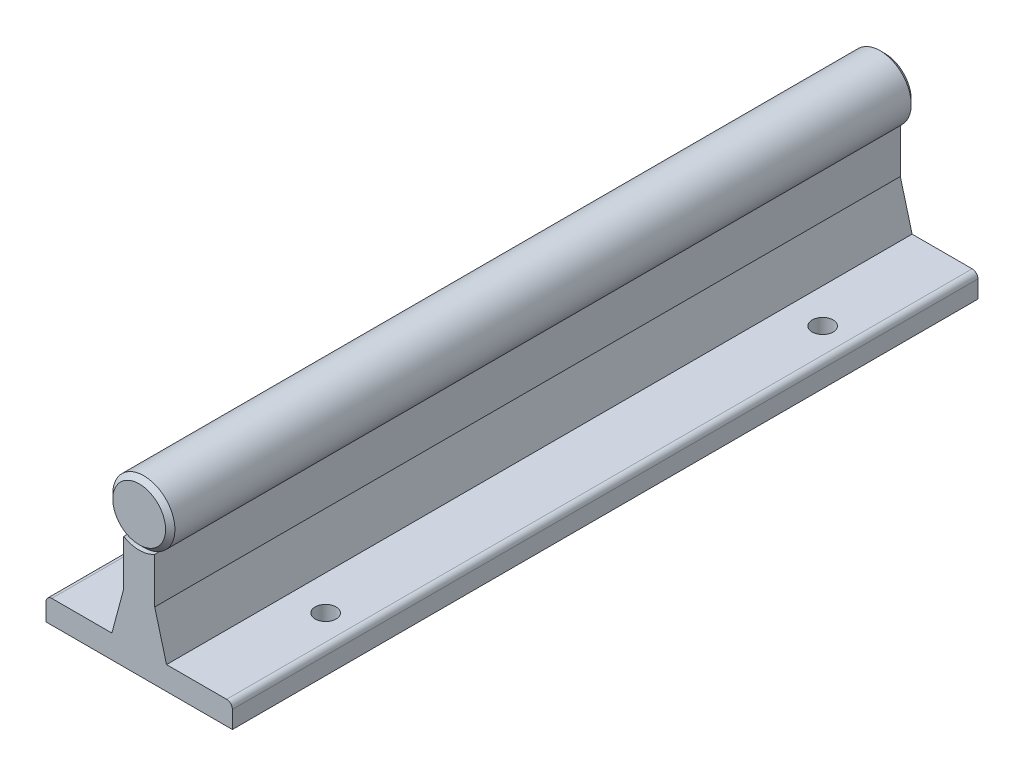
ISO-10303-21;
HEADER;
FILE_DESCRIPTION(('STEP AP214'),'2;1');
FILE_NAME('part.step','',(''),(''),'','','');
FILE_SCHEMA(('AUTOMOTIVE_DESIGN { 1 0 10303 214 1 1 1 1 }'));
ENDSEC;
DATA;
#1=APPLICATION_CONTEXT('core data for automotive mechanical design processes');
#2=APPLICATION_PROTOCOL_DEFINITION('international standard','automotive_design',2000,#1);
#3=PRODUCT_CONTEXT('',#1,'mechanical');
#4=PRODUCT('Part','Part','',(#3));
#5=PRODUCT_RELATED_PRODUCT_CATEGORY('part','',(#4));
#6=PRODUCT_DEFINITION_FORMATION('','',#4);
#7=PRODUCT_DEFINITION_CONTEXT('part definition',#1,'design');
#8=PRODUCT_DEFINITION('design','',#6,#7);
#9=PRODUCT_DEFINITION_SHAPE('','',#8);
#10=(LENGTH_UNIT() NAMED_UNIT(*) SI_UNIT(.MILLI.,.METRE.));
#11=(NAMED_UNIT(*) PLANE_ANGLE_UNIT() SI_UNIT($,.RADIAN.));
#12=(NAMED_UNIT(*) SI_UNIT($,.STERADIAN.) SOLID_ANGLE_UNIT());
#13=UNCERTAINTY_MEASURE_WITH_UNIT(LENGTH_MEASURE(1.E-05),#10,'distance_accuracy_value','');
#14=(GEOMETRIC_REPRESENTATION_CONTEXT(3) GLOBAL_UNCERTAINTY_ASSIGNED_CONTEXT((#13)) GLOBAL_UNIT_ASSIGNED_CONTEXT((#10,
#11,#12)) REPRESENTATION_CONTEXT('',''));
#15=CARTESIAN_POINT('',(0.,0.,0.));
#16=DIRECTION('',(0.,0.,1.));
#17=DIRECTION('',(1.,0.,0.));
#18=AXIS2_PLACEMENT_3D('',#15,#16,#17);
#19=CARTESIAN_POINT('',(-19.05,0.,76.2));
#20=DIRECTION('',(0.,1.,0.));
#21=DIRECTION('',(0.,0.,1.));
#22=AXIS2_PLACEMENT_3D('',#19,#20,#21);
#23=PLANE('',#22);
#24=CARTESIAN_POINT('',(12.7,0.,-50.8));
#25=DIRECTION('',(0.,1.,0.));
#26=DIRECTION('',(0.,0.,1.));
#27=AXIS2_PLACEMENT_3D('',#24,#25,#26);
#28=CIRCLE('',#27,2.1463);
#29=CARTESIAN_POINT('',(12.7,0.,-48.6537));
#30=VERTEX_POINT('',#29);
#31=EDGE_CURVE('E386',#30,#30,#28,.T.);
#32=ORIENTED_EDGE('',*,*,#31,.T.);
#33=EDGE_LOOP('',(#32));
#34=FACE_BOUND('',#33,.T.);
#35=CARTESIAN_POINT('',(12.7,0.,50.8));
#36=DIRECTION('',(0.,1.,0.));
#37=DIRECTION('',(0.,0.,1.));
#38=AXIS2_PLACEMENT_3D('',#35,#36,#37);
#39=CIRCLE('',#38,2.1463);
#40=CARTESIAN_POINT('',(12.7,0.,52.9463));
#41=VERTEX_POINT('',#40);
#42=EDGE_CURVE('E401',#41,#41,#39,.T.);
#43=ORIENTED_EDGE('',*,*,#42,.T.);
#44=EDGE_LOOP('',(#43));
#45=FACE_BOUND('',#44,.T.);
#46=DIRECTION('',(1.,0.,0.));
#47=VECTOR('',#46,1.);
#48=CARTESIAN_POINT('',(-19.05,0.,-76.2));
#49=LINE('',#48,#47);
#50=CARTESIAN_POINT('',(-19.05,0.,-76.2));
#51=VERTEX_POINT('',#50);
#52=CARTESIAN_POINT('',(19.05,0.,-76.2));
#53=VERTEX_POINT('',#52);
#54=EDGE_CURVE('E252',#51,#53,#49,.T.);
#55=ORIENTED_EDGE('',*,*,#54,.T.);
#56=DIRECTION('',(0.,0.,-1.));
#57=VECTOR('',#56,1.);
#58=CARTESIAN_POINT('',(19.05,0.,76.2));
#59=LINE('',#58,#57);
#60=CARTESIAN_POINT('',(19.05,0.,76.2));
#61=VERTEX_POINT('',#60);
#62=EDGE_CURVE('E217',#61,#53,#59,.T.);
#63=ORIENTED_EDGE('',*,*,#62,.F.);
#64=DIRECTION('',(1.,0.,0.));
#65=VECTOR('',#64,1.);
#66=CARTESIAN_POINT('',(-19.05,0.,76.2));
#67=LINE('',#66,#65);
#68=CARTESIAN_POINT('',(-19.05,0.,76.2));
#69=VERTEX_POINT('',#68);
#70=EDGE_CURVE('E421',#69,#61,#67,.T.);
#71=ORIENTED_EDGE('',*,*,#70,.F.);
#72=DIRECTION('',(0.,0.,-1.));
#73=VECTOR('',#72,1.);
#74=CARTESIAN_POINT('',(-19.05,0.,76.2));
#75=LINE('',#74,#73);
#76=EDGE_CURVE('E221',#69,#51,#75,.T.);
#77=ORIENTED_EDGE('',*,*,#76,.T.);
#78=EDGE_LOOP('',(#55,#63,#71,#77));
#79=FACE_BOUND('',#78,.T.);
#80=CARTESIAN_POINT('',(-12.7,0.,50.8));
#81=DIRECTION('',(0.,1.,0.));
#82=DIRECTION('',(0.,0.,1.));
#83=AXIS2_PLACEMENT_3D('',#80,#81,#82);
#84=CIRCLE('',#83,2.1463);
#85=CARTESIAN_POINT('',(-12.7,0.,52.9463));
#86=VERTEX_POINT('',#85);
#87=EDGE_CURVE('E393',#86,#86,#84,.T.);
#88=ORIENTED_EDGE('',*,*,#87,.T.);
#89=EDGE_LOOP('',(#88));
#90=FACE_BOUND('',#89,.T.);
#91=CARTESIAN_POINT('',(-12.7,0.,-50.8));
#92=DIRECTION('',(0.,1.,0.));
#93=DIRECTION('',(0.,0.,1.));
#94=AXIS2_PLACEMENT_3D('',#91,#92,#93);
#95=CIRCLE('',#94,2.1463);
#96=CARTESIAN_POINT('',(-12.7,0.,-48.6537));
#97=VERTEX_POINT('',#96);
#98=EDGE_CURVE('E383',#97,#97,#95,.T.);
#99=ORIENTED_EDGE('',*,*,#98,.T.);
#100=EDGE_LOOP('',(#99));
#101=FACE_BOUND('',#100,.T.);
#102=ADVANCED_FACE('F38',(#34,#45,#79,#90,#101),#23,.F.);
#103=CARTESIAN_POINT('',(-5.58598361192192,4.7625,76.2));
#104=DIRECTION('',(0.,-1.,0.));
#105=DIRECTION('',(1.,0.,0.));
#106=AXIS2_PLACEMENT_3D('',#103,#104,#105);
#107=PLANE('',#106);
#108=CARTESIAN_POINT('',(-12.7,4.7625,50.8));
#109=DIRECTION('',(0.,-1.,0.));
#110=DIRECTION('',(1.,0.,0.));
#111=AXIS2_PLACEMENT_3D('',#108,#109,#110);
#112=CIRCLE('',#111,2.1463);
#113=CARTESIAN_POINT('',(-10.5537,4.7625,50.8));
#114=VERTEX_POINT('',#113);
#115=EDGE_CURVE('E397',#114,#114,#112,.T.);
#116=ORIENTED_EDGE('',*,*,#115,.T.);
#117=EDGE_LOOP('',(#116));
#118=FACE_BOUND('',#117,.T.);
#119=DIRECTION('',(-1.,0.,0.));
#120=VECTOR('',#119,1.);
#121=CARTESIAN_POINT('',(-5.58598361192192,4.7625,-76.2));
#122=LINE('',#121,#120);
#123=CARTESIAN_POINT('',(-5.58598361192192,4.7625,-76.2));
#124=VERTEX_POINT('',#123);
#125=CARTESIAN_POINT('',(-17.859375,4.7625,-76.2));
#126=VERTEX_POINT('',#125);
#127=EDGE_CURVE('E186',#124,#126,#122,.T.);
#128=ORIENTED_EDGE('',*,*,#127,.T.);
#129=DIRECTION('',(0.,0.,-1.));
#130=VECTOR('',#129,1.);
#131=CARTESIAN_POINT('',(-17.859375,4.7625,76.2));
#132=LINE('',#131,#130);
#133=CARTESIAN_POINT('',(-17.859375,4.7625,76.2));
#134=VERTEX_POINT('',#133);
#135=EDGE_CURVE('E11',#126,#134,#132,.F.);
#136=ORIENTED_EDGE('',*,*,#135,.T.);
#137=DIRECTION('',(-1.,0.,0.));
#138=VECTOR('',#137,1.);
#139=CARTESIAN_POINT('',(-5.58598361192192,4.7625,76.2));
#140=LINE('',#139,#138);
#141=CARTESIAN_POINT('',(-5.58598361192192,4.7625,76.2));
#142=VERTEX_POINT('',#141);
#143=EDGE_CURVE('E199',#142,#134,#140,.T.);
#144=ORIENTED_EDGE('',*,*,#143,.F.);
#145=DIRECTION('',(0.,0.,-1.));
#146=VECTOR('',#145,1.);
#147=CARTESIAN_POINT('',(-5.58598361192192,4.7625,76.2));
#148=LINE('',#147,#146);
#149=EDGE_CURVE('E194',#142,#124,#148,.T.);
#150=ORIENTED_EDGE('',*,*,#149,.T.);
#151=EDGE_LOOP('',(#128,#136,#144,#150));
#152=FACE_BOUND('',#151,.T.);
#153=CARTESIAN_POINT('',(-12.7,4.7625,-50.8));
#154=DIRECTION('',(0.,-1.,0.));
#155=DIRECTION('',(1.,0.,0.));
#156=AXIS2_PLACEMENT_3D('',#153,#154,#155);
#157=CIRCLE('',#156,2.1463);
#158=CARTESIAN_POINT('',(-10.5537,4.7625,-50.8));
#159=VERTEX_POINT('',#158);
#160=EDGE_CURVE('E380',#159,#159,#157,.T.);
#161=ORIENTED_EDGE('',*,*,#160,.T.);
#162=EDGE_LOOP('',(#161));
#163=FACE_BOUND('',#162,.T.);
#164=ADVANCED_FACE('F312',(#118,#152,#163),#107,.F.);
#165=CARTESIAN_POINT('',(19.05,4.7625,76.2));
#166=DIRECTION('',(0.,-1.,0.));
#167=DIRECTION('',(1.,0.,0.));
#168=AXIS2_PLACEMENT_3D('',#165,#166,#167);
#169=PLANE('',#168);
#170=CARTESIAN_POINT('',(12.7,4.7625,50.8));
#171=DIRECTION('',(0.,-1.,0.));
#172=DIRECTION('',(1.,0.,0.));
#173=AXIS2_PLACEMENT_3D('',#170,#171,#172);
#174=CIRCLE('',#173,2.1463);
#175=CARTESIAN_POINT('',(14.8463,4.7625,50.8));
#176=VERTEX_POINT('',#175);
#177=EDGE_CURVE('E166',#176,#176,#174,.T.);
#178=ORIENTED_EDGE('',*,*,#177,.T.);
#179=EDGE_LOOP('',(#178));
#180=FACE_BOUND('',#179,.T.);
#181=DIRECTION('',(-1.,0.,0.));
#182=VECTOR('',#181,1.);
#183=CARTESIAN_POINT('',(19.05,4.7625,76.2));
#184=LINE('',#183,#182);
#185=CARTESIAN_POINT('',(17.859375,4.7625,76.2));
#186=VERTEX_POINT('',#185);
#187=CARTESIAN_POINT('',(5.58598361192192,4.7625,76.2));
#188=VERTEX_POINT('',#187);
#189=EDGE_CURVE('E289',#186,#188,#184,.T.);
#190=ORIENTED_EDGE('',*,*,#189,.F.);
#191=DIRECTION('',(0.,0.,-1.));
#192=VECTOR('',#191,1.);
#193=CARTESIAN_POINT('',(17.859375,4.7625,76.2));
#194=LINE('',#193,#192);
#195=CARTESIAN_POINT('',(17.859375,4.7625,-76.2));
#196=VERTEX_POINT('',#195);
#197=EDGE_CURVE('E225',#186,#196,#194,.T.);
#198=ORIENTED_EDGE('',*,*,#197,.T.);
#199=DIRECTION('',(-1.,0.,0.));
#200=VECTOR('',#199,1.);
#201=CARTESIAN_POINT('',(19.05,4.7625,-76.2));
#202=LINE('',#201,#200);
#203=CARTESIAN_POINT('',(5.58598361192192,4.7625,-76.2));
#204=VERTEX_POINT('',#203);
#205=EDGE_CURVE('E266',#196,#204,#202,.T.);
#206=ORIENTED_EDGE('',*,*,#205,.T.);
#207=DIRECTION('',(0.,0.,-1.));
#208=VECTOR('',#207,1.);
#209=CARTESIAN_POINT('',(5.58598361192192,4.7625,76.2));
#210=LINE('',#209,#208);
#211=EDGE_CURVE('E213',#188,#204,#210,.T.);
#212=ORIENTED_EDGE('',*,*,#211,.F.);
#213=EDGE_LOOP('',(#190,#198,#206,#212));
#214=FACE_BOUND('',#213,.T.);
#215=CARTESIAN_POINT('',(12.7,4.7625,-50.8));
#216=DIRECTION('',(0.,-1.,0.));
#217=DIRECTION('',(1.,0.,0.));
#218=AXIS2_PLACEMENT_3D('',#215,#216,#217);
#219=CIRCLE('',#218,2.1463);
#220=CARTESIAN_POINT('',(14.8463,4.7625,-50.8));
#221=VERTEX_POINT('',#220);
#222=EDGE_CURVE('E390',#221,#221,#219,.T.);
#223=ORIENTED_EDGE('',*,*,#222,.T.);
#224=EDGE_LOOP('',(#223));
#225=FACE_BOUND('',#224,.T.);
#226=ADVANCED_FACE('F318',(#180,#214,#225),#169,.F.);
#227=CARTESIAN_POINT('',(0.,28.575,76.2));
#228=DIRECTION('',(0.,0.,-1.));
#229=DIRECTION('',(-1.,0.,0.));
#230=AXIS2_PLACEMENT_3D('',#227,#228,#229);
#231=CYLINDRICAL_SURFACE('',#230,6.35);
#232=CARTESIAN_POINT('',(0.,28.575,-75.2475));
#233=DIRECTION('',(0.,0.,1.));
#234=DIRECTION('',(1.,0.,0.));
#235=AXIS2_PLACEMENT_3D('',#232,#233,#234);
#236=CIRCLE('',#235,6.35);
#237=CARTESIAN_POINT('',(3.175,23.0757386859688,-75.2475));
#238=VERTEX_POINT('',#237);
#239=CARTESIAN_POINT('',(-3.175,23.0757386859688,-75.2475));
#240=VERTEX_POINT('',#239);
#241=EDGE_CURVE('E165',#238,#240,#236,.T.);
#242=ORIENTED_EDGE('',*,*,#241,.T.);
#243=DIRECTION('',(0.,0.,-1.));
#244=VECTOR('',#243,1.);
#245=CARTESIAN_POINT('',(-3.17500000000001,23.0757386859688,76.2));
#246=LINE('',#245,#244);
#247=CARTESIAN_POINT('',(-3.175,23.0757386859688,75.2475));
#248=VERTEX_POINT('',#247);
#249=EDGE_CURVE('E176',#248,#240,#246,.T.);
#250=ORIENTED_EDGE('',*,*,#249,.F.);
#251=CARTESIAN_POINT('',(0.,28.575,75.2475));
#252=DIRECTION('',(0.,0.,1.));
#253=DIRECTION('',(1.,0.,0.));
#254=AXIS2_PLACEMENT_3D('',#251,#252,#253);
#255=CIRCLE('',#254,6.35);
#256=CARTESIAN_POINT('',(3.175,23.0757386859688,75.2475));
#257=VERTEX_POINT('',#256);
#258=EDGE_CURVE('E417',#257,#248,#255,.T.);
#259=ORIENTED_EDGE('',*,*,#258,.F.);
#260=DIRECTION('',(0.,0.,-1.));
#261=VECTOR('',#260,1.);
#262=CARTESIAN_POINT('',(3.175,23.0757386859688,76.2));
#263=LINE('',#262,#261);
#264=EDGE_CURVE('E205',#257,#238,#263,.T.);
#265=ORIENTED_EDGE('',*,*,#264,.T.);
#266=EDGE_LOOP('',(#242,#250,#259,#265));
#267=FACE_BOUND('',#266,.T.);
#268=ADVANCED_FACE('F338',(#267),#231,.T.);
#269=CARTESIAN_POINT('',(0.,28.575,-76.2));
#270=DIRECTION('',(0.,0.,1.));
#271=DIRECTION('',(1.,0.,0.));
#272=AXIS2_PLACEMENT_3D('',#269,#270,#271);
#273=PLANE('',#272);
#274=ORIENTED_EDGE('',*,*,#205,.F.);
#275=CARTESIAN_POINT('',(17.859375,3.571875,-76.2));
#276=DIRECTION('',(0.,0.,1.));
#277=DIRECTION('',(1.,0.,0.));
#278=AXIS2_PLACEMENT_3D('',#275,#276,#277);
#279=CIRCLE('',#278,1.190625);
#280=CARTESIAN_POINT('',(19.05,3.571875,-76.2));
#281=VERTEX_POINT('',#280);
#282=EDGE_CURVE('E231',#196,#281,#279,.F.);
#283=ORIENTED_EDGE('',*,*,#282,.T.);
#284=DIRECTION('',(0.,1.,0.));
#285=VECTOR('',#284,1.);
#286=CARTESIAN_POINT('',(19.05,0.,-76.2));
#287=LINE('',#286,#285);
#288=EDGE_CURVE('E255',#53,#281,#287,.T.);
#289=ORIENTED_EDGE('',*,*,#288,.F.);
#290=ORIENTED_EDGE('',*,*,#54,.F.);
#291=DIRECTION('',(0.,-1.,0.));
#292=VECTOR('',#291,1.);
#293=CARTESIAN_POINT('',(-19.05,4.7625,-76.2));
#294=LINE('',#293,#292);
#295=CARTESIAN_POINT('',(-19.05,3.571875,-76.2));
#296=VERTEX_POINT('',#295);
#297=EDGE_CURVE('E248',#296,#51,#294,.T.);
#298=ORIENTED_EDGE('',*,*,#297,.F.);
#299=CARTESIAN_POINT('',(-17.859375,3.571875,-76.2));
#300=DIRECTION('',(0.,0.,1.));
#301=DIRECTION('',(1.,0.,0.));
#302=AXIS2_PLACEMENT_3D('',#299,#300,#301);
#303=CIRCLE('',#302,1.190625);
#304=EDGE_CURVE('E229',#296,#126,#303,.F.);
#305=ORIENTED_EDGE('',*,*,#304,.T.);
#306=ORIENTED_EDGE('',*,*,#127,.F.);
#307=DIRECTION('',(-0.258819045102521,-0.965925826289068,0.));
#308=VECTOR('',#307,1.);
#309=CARTESIAN_POINT('',(-3.175,13.7604133359085,-76.2));
#310=LINE('',#309,#308);
#311=CARTESIAN_POINT('',(-3.175,13.7604133359085,-76.2));
#312=VERTEX_POINT('',#311);
#313=EDGE_CURVE('E183',#312,#124,#310,.T.);
#314=ORIENTED_EDGE('',*,*,#313,.F.);
#315=DIRECTION('',(0.,-1.,0.));
#316=VECTOR('',#315,1.);
#317=CARTESIAN_POINT('',(-3.175,23.0757386859688,-76.2));
#318=LINE('',#317,#316);
#319=CARTESIAN_POINT('',(-3.175,23.0757386859688,-76.2));
#320=VERTEX_POINT('',#319);
#321=EDGE_CURVE('E172',#320,#312,#318,.T.);
#322=ORIENTED_EDGE('',*,*,#321,.F.);
#323=CARTESIAN_POINT('',(0.,28.575,-76.2));
#324=DIRECTION('',(0.,0.,1.));
#325=DIRECTION('',(1.,0.,0.));
#326=AXIS2_PLACEMENT_3D('',#323,#324,#325);
#327=CIRCLE('',#326,6.35);
#328=CARTESIAN_POINT('',(3.175,23.0757386859688,-76.2));
#329=VERTEX_POINT('',#328);
#330=EDGE_CURVE('E153',#320,#329,#327,.T.);
#331=ORIENTED_EDGE('',*,*,#330,.T.);
#332=DIRECTION('',(0.,1.,0.));
#333=VECTOR('',#332,1.);
#334=CARTESIAN_POINT('',(3.175,23.0757386859688,-76.2));
#335=LINE('',#334,#333);
#336=CARTESIAN_POINT('',(3.175,13.7604133359085,-76.2));
#337=VERTEX_POINT('',#336);
#338=EDGE_CURVE('E184',#337,#329,#335,.T.);
#339=ORIENTED_EDGE('',*,*,#338,.F.);
#340=DIRECTION('',(-0.258819045102521,0.965925826289068,0.));
#341=VECTOR('',#340,1.);
#342=CARTESIAN_POINT('',(3.175,13.7604133359085,-76.2));
#343=LINE('',#342,#341);
#344=EDGE_CURVE('E188',#204,#337,#343,.T.);
#345=ORIENTED_EDGE('',*,*,#344,.F.);
#346=EDGE_LOOP('',(#274,#283,#289,#290,#298,#305,#306,#314,#322,#331,#339,#345));
#347=FACE_BOUND('',#346,.T.);
#348=ADVANCED_FACE('F181',(#347),#273,.F.);
#349=CARTESIAN_POINT('',(0.,28.575,76.2));
#350=DIRECTION('',(0.,0.,1.));
#351=DIRECTION('',(1.,0.,0.));
#352=AXIS2_PLACEMENT_3D('',#349,#350,#351);
#353=PLANE('',#352);
#354=DIRECTION('',(0.,1.,0.));
#355=VECTOR('',#354,1.);
#356=CARTESIAN_POINT('',(19.05,0.,76.2));
#357=LINE('',#356,#355);
#358=CARTESIAN_POINT('',(19.05,3.571875,76.2));
#359=VERTEX_POINT('',#358);
#360=EDGE_CURVE('E423',#61,#359,#357,.T.);
#361=ORIENTED_EDGE('',*,*,#360,.T.);
#362=CARTESIAN_POINT('',(17.859375,3.571875,76.2));
#363=DIRECTION('',(0.,0.,1.));
#364=DIRECTION('',(1.,0.,0.));
#365=AXIS2_PLACEMENT_3D('',#362,#363,#364);
#366=CIRCLE('',#365,1.190625);
#367=EDGE_CURVE('E238',#359,#186,#366,.T.);
#368=ORIENTED_EDGE('',*,*,#367,.T.);
#369=ORIENTED_EDGE('',*,*,#189,.T.);
#370=DIRECTION('',(-0.258819045102521,0.965925826289068,0.));
#371=VECTOR('',#370,1.);
#372=CARTESIAN_POINT('',(3.175,13.7604133359085,76.2));
#373=LINE('',#372,#371);
#374=CARTESIAN_POINT('',(3.175,13.7604133359085,76.2));
#375=VERTEX_POINT('',#374);
#376=EDGE_CURVE('E283',#188,#375,#373,.T.);
#377=ORIENTED_EDGE('',*,*,#376,.T.);
#378=DIRECTION('',(0.,1.,0.));
#379=VECTOR('',#378,1.);
#380=CARTESIAN_POINT('',(3.175,23.0757386859688,76.2));
#381=LINE('',#380,#379);
#382=CARTESIAN_POINT('',(3.175,23.0757386859688,76.2));
#383=VERTEX_POINT('',#382);
#384=EDGE_CURVE('E278',#375,#383,#381,.T.);
#385=ORIENTED_EDGE('',*,*,#384,.T.);
#386=CARTESIAN_POINT('',(0.,28.575,76.2));
#387=DIRECTION('',(0.,0.,1.));
#388=DIRECTION('',(1.,0.,0.));
#389=AXIS2_PLACEMENT_3D('',#386,#387,#388);
#390=CIRCLE('',#389,6.35);
#391=CARTESIAN_POINT('',(-3.17500000000001,23.0757386859688,76.2));
#392=VERTEX_POINT('',#391);
#393=EDGE_CURVE('E414',#392,#383,#390,.T.);
#394=ORIENTED_EDGE('',*,*,#393,.F.);
#395=DIRECTION('',(0.,-1.,0.));
#396=VECTOR('',#395,1.);
#397=CARTESIAN_POINT('',(-3.175,23.0757386859688,76.2));
#398=LINE('',#397,#396);
#399=CARTESIAN_POINT('',(-3.175,13.7604133359085,76.2));
#400=VERTEX_POINT('',#399);
#401=EDGE_CURVE('E282',#392,#400,#398,.T.);
#402=ORIENTED_EDGE('',*,*,#401,.T.);
#403=DIRECTION('',(-0.258819045102521,-0.965925826289068,0.));
#404=VECTOR('',#403,1.);
#405=CARTESIAN_POINT('',(-3.175,13.7604133359085,76.2));
#406=LINE('',#405,#404);
#407=EDGE_CURVE('E286',#400,#142,#406,.T.);
#408=ORIENTED_EDGE('',*,*,#407,.T.);
#409=ORIENTED_EDGE('',*,*,#143,.T.);
#410=CARTESIAN_POINT('',(-17.859375,3.571875,76.2));
#411=DIRECTION('',(0.,0.,1.));
#412=DIRECTION('',(1.,0.,0.));
#413=AXIS2_PLACEMENT_3D('',#410,#411,#412);
#414=CIRCLE('',#413,1.190625);
#415=CARTESIAN_POINT('',(-19.05,3.571875,76.2));
#416=VERTEX_POINT('',#415);
#417=EDGE_CURVE('E57',#134,#416,#414,.T.);
#418=ORIENTED_EDGE('',*,*,#417,.T.);
#419=DIRECTION('',(0.,-1.,0.));
#420=VECTOR('',#419,1.);
#421=CARTESIAN_POINT('',(-19.05,4.7625,76.2));
#422=LINE('',#421,#420);
#423=EDGE_CURVE('E193',#416,#69,#422,.T.);
#424=ORIENTED_EDGE('',*,*,#423,.T.);
#425=ORIENTED_EDGE('',*,*,#70,.T.);
#426=EDGE_LOOP('',(#361,#368,#369,#377,#385,#394,#402,#408,#409,#418,#424,#425));
#427=FACE_BOUND('',#426,.T.);
#428=ADVANCED_FACE('F298',(#427),#353,.T.);
#429=CARTESIAN_POINT('',(-19.05,4.7625,76.2));
#430=DIRECTION('',(1.,0.,0.));
#431=DIRECTION('',(0.,1.,0.));
#432=AXIS2_PLACEMENT_3D('',#429,#430,#431);
#433=PLANE('',#432);
#434=ORIENTED_EDGE('',*,*,#423,.F.);
#435=DIRECTION('',(0.,0.,-1.));
#436=VECTOR('',#435,1.);
#437=CARTESIAN_POINT('',(-19.05,3.571875,76.2));
#438=LINE('',#437,#436);
#439=EDGE_CURVE('E47',#416,#296,#438,.T.);
#440=ORIENTED_EDGE('',*,*,#439,.T.);
#441=ORIENTED_EDGE('',*,*,#297,.T.);
#442=ORIENTED_EDGE('',*,*,#76,.F.);
#443=EDGE_LOOP('',(#434,#440,#441,#442));
#444=FACE_BOUND('',#443,.T.);
#445=ADVANCED_FACE('F246',(#444),#433,.F.);
#446=CARTESIAN_POINT('',(19.05,0.,76.2));
#447=DIRECTION('',(-1.,0.,0.));
#448=DIRECTION('',(0.,-1.,0.));
#449=AXIS2_PLACEMENT_3D('',#446,#447,#448);
#450=PLANE('',#449);
#451=ORIENTED_EDGE('',*,*,#288,.T.);
#452=DIRECTION('',(0.,0.,-1.));
#453=VECTOR('',#452,1.);
#454=CARTESIAN_POINT('',(19.05,3.571875,76.2));
#455=LINE('',#454,#453);
#456=EDGE_CURVE('E233',#281,#359,#455,.F.);
#457=ORIENTED_EDGE('',*,*,#456,.T.);
#458=ORIENTED_EDGE('',*,*,#360,.F.);
#459=ORIENTED_EDGE('',*,*,#62,.T.);
#460=EDGE_LOOP('',(#451,#457,#458,#459));
#461=FACE_BOUND('',#460,.T.);
#462=ADVANCED_FACE('F325',(#461),#450,.F.);
#463=CARTESIAN_POINT('',(3.175,13.7604133359085,76.2));
#464=DIRECTION('',(-0.965925826289068,-0.258819045102521,0.));
#465=DIRECTION('',(0.258819045102521,-0.965925826289068,0.));
#466=AXIS2_PLACEMENT_3D('',#463,#464,#465);
#467=PLANE('',#466);
#468=ORIENTED_EDGE('',*,*,#344,.T.);
#469=DIRECTION('',(0.,0.,-1.));
#470=VECTOR('',#469,1.);
#471=CARTESIAN_POINT('',(3.175,13.7604133359085,76.2));
#472=LINE('',#471,#470);
#473=EDGE_CURVE('E209',#375,#337,#472,.T.);
#474=ORIENTED_EDGE('',*,*,#473,.F.);
#475=ORIENTED_EDGE('',*,*,#376,.F.);
#476=ORIENTED_EDGE('',*,*,#211,.T.);
#477=EDGE_LOOP('',(#468,#474,#475,#476));
#478=FACE_BOUND('',#477,.T.);
#479=ADVANCED_FACE('F270',(#478),#467,.F.);
#480=CARTESIAN_POINT('',(3.175,23.0757386859688,76.2));
#481=DIRECTION('',(-1.,0.,0.));
#482=DIRECTION('',(0.,0.,1.));
#483=AXIS2_PLACEMENT_3D('',#480,#481,#482);
#484=PLANE('',#483);
#485=ORIENTED_EDGE('',*,*,#338,.T.);
#486=DIRECTION('',(0.,0.,-1.));
#487=VECTOR('',#486,1.);
#488=CARTESIAN_POINT('',(3.175,23.0757386859688,-75.2475));
#489=LINE('',#488,#487);
#490=EDGE_CURVE('E160',#238,#329,#489,.T.);
#491=ORIENTED_EDGE('',*,*,#490,.F.);
#492=ORIENTED_EDGE('',*,*,#264,.F.);
#493=EDGE_CURVE('E206',#383,#257,#263,.T.);
#494=ORIENTED_EDGE('',*,*,#493,.F.);
#495=ORIENTED_EDGE('',*,*,#384,.F.);
#496=ORIENTED_EDGE('',*,*,#473,.T.);
#497=EDGE_LOOP('',(#485,#491,#492,#494,#495,#496));
#498=FACE_BOUND('',#497,.T.);
#499=ADVANCED_FACE('F275',(#498),#484,.F.);
#500=CARTESIAN_POINT('',(-3.175,23.0757386859688,76.2));
#501=DIRECTION('',(1.,0.,0.));
#502=DIRECTION('',(0.,0.,-1.));
#503=AXIS2_PLACEMENT_3D('',#500,#501,#502);
#504=PLANE('',#503);
#505=ORIENTED_EDGE('',*,*,#321,.T.);
#506=DIRECTION('',(0.,0.,-1.));
#507=VECTOR('',#506,1.);
#508=CARTESIAN_POINT('',(-3.175,13.7604133359085,76.2));
#509=LINE('',#508,#507);
#510=EDGE_CURVE('E198',#400,#312,#509,.T.);
#511=ORIENTED_EDGE('',*,*,#510,.F.);
#512=ORIENTED_EDGE('',*,*,#401,.F.);
#513=EDGE_CURVE('E202',#392,#248,#246,.T.);
#514=ORIENTED_EDGE('',*,*,#513,.T.);
#515=ORIENTED_EDGE('',*,*,#249,.T.);
#516=DIRECTION('',(0.,0.,-1.));
#517=VECTOR('',#516,1.);
#518=CARTESIAN_POINT('',(-3.175,23.0757386859688,-75.2475));
#519=LINE('',#518,#517);
#520=EDGE_CURVE('E157',#320,#240,#519,.F.);
#521=ORIENTED_EDGE('',*,*,#520,.F.);
#522=EDGE_LOOP('',(#505,#511,#512,#514,#515,#521));
#523=FACE_BOUND('',#522,.T.);
#524=ADVANCED_FACE('F170',(#523),#504,.F.);
#525=CARTESIAN_POINT('',(-3.175,13.7604133359085,76.2));
#526=DIRECTION('',(0.965925826289068,-0.258819045102521,0.));
#527=DIRECTION('',(0.258819045102521,0.965925826289068,0.));
#528=AXIS2_PLACEMENT_3D('',#525,#526,#527);
#529=PLANE('',#528);
#530=ORIENTED_EDGE('',*,*,#313,.T.);
#531=ORIENTED_EDGE('',*,*,#149,.F.);
#532=ORIENTED_EDGE('',*,*,#407,.F.);
#533=ORIENTED_EDGE('',*,*,#510,.T.);
#534=EDGE_LOOP('',(#530,#531,#532,#533));
#535=FACE_BOUND('',#534,.T.);
#536=ADVANCED_FACE('F357',(#535),#529,.F.);
#537=CARTESIAN_POINT('',(0.,28.575,76.2));
#538=DIRECTION('',(0.,0.,1.));
#539=DIRECTION('',(1.,0.,0.));
#540=AXIS2_PLACEMENT_3D('',#537,#538,#539);
#541=CYLINDRICAL_SURFACE('',#540,6.35);
#542=ORIENTED_EDGE('',*,*,#493,.T.);
#543=EDGE_CURVE('E259',#248,#257,#255,.T.);
#544=ORIENTED_EDGE('',*,*,#543,.F.);
#545=ORIENTED_EDGE('',*,*,#513,.F.);
#546=ORIENTED_EDGE('',*,*,#393,.T.);
#547=EDGE_LOOP('',(#542,#544,#545,#546));
#548=FACE_BOUND('',#547,.T.);
#549=ADVANCED_FACE('F350',(#548),#541,.F.);
#550=CARTESIAN_POINT('',(0.,28.575,76.2));
#551=DIRECTION('',(0.,0.,-1.));
#552=DIRECTION('',(-1.,0.,0.));
#553=AXIS2_PLACEMENT_3D('',#550,#551,#552);
#554=CONICAL_SURFACE('',#553,5.39749999999999,0.785398163397448);
#555=ORIENTED_EDGE('',*,*,#543,.T.);
#556=ORIENTED_EDGE('',*,*,#258,.T.);
#557=EDGE_LOOP('',(#555,#556));
#558=FACE_BOUND('',#557,.T.);
#559=CARTESIAN_POINT('',(0.,28.575,76.2));
#560=DIRECTION('',(0.,0.,1.));
#561=DIRECTION('',(1.,0.,0.));
#562=AXIS2_PLACEMENT_3D('',#559,#560,#561);
#563=CIRCLE('',#562,5.39749999999999);
#564=CARTESIAN_POINT('',(5.39749999999999,28.575,76.2));
#565=VERTEX_POINT('',#564);
#566=EDGE_CURVE('E253',#565,#565,#563,.T.);
#567=ORIENTED_EDGE('',*,*,#566,.F.);
#568=EDGE_LOOP('',(#567));
#569=FACE_BOUND('',#568,.T.);
#570=ADVANCED_FACE('F342',(#558,#569),#554,.T.);
#571=ORIENTED_EDGE('',*,*,#566,.T.);
#572=EDGE_LOOP('',(#571));
#573=FACE_BOUND('',#572,.T.);
#574=ADVANCED_FACE('F334',(#573),#353,.T.);
#575=CARTESIAN_POINT('',(0.,28.575,-75.2475));
#576=DIRECTION('',(0.,0.,-1.));
#577=DIRECTION('',(1.,0.,0.));
#578=AXIS2_PLACEMENT_3D('',#575,#576,#577);
#579=CYLINDRICAL_SURFACE('',#578,6.35);
#580=ORIENTED_EDGE('',*,*,#490,.T.);
#581=ORIENTED_EDGE('',*,*,#330,.F.);
#582=ORIENTED_EDGE('',*,*,#520,.T.);
#583=EDGE_CURVE('E408',#240,#238,#236,.T.);
#584=ORIENTED_EDGE('',*,*,#583,.T.);
#585=EDGE_LOOP('',(#580,#581,#582,#584));
#586=FACE_BOUND('',#585,.T.);
#587=ADVANCED_FACE('F155',(#586),#579,.F.);
#588=CARTESIAN_POINT('',(0.,28.575,-76.2));
#589=DIRECTION('',(0.,0.,1.));
#590=DIRECTION('',(-1.,0.,0.));
#591=AXIS2_PLACEMENT_3D('',#588,#589,#590);
#592=CONICAL_SURFACE('',#591,5.39749999999999,0.785398163397448);
#593=ORIENTED_EDGE('',*,*,#583,.F.);
#594=ORIENTED_EDGE('',*,*,#241,.F.);
#595=EDGE_LOOP('',(#593,#594));
#596=FACE_BOUND('',#595,.T.);
#597=CARTESIAN_POINT('',(0.,28.575,-76.2));
#598=DIRECTION('',(0.,0.,1.));
#599=DIRECTION('',(1.,0.,0.));
#600=AXIS2_PLACEMENT_3D('',#597,#598,#599);
#601=CIRCLE('',#600,5.39749999999999);
#602=CARTESIAN_POINT('',(5.39749999999999,28.575,-76.2));
#603=VERTEX_POINT('',#602);
#604=EDGE_CURVE('E177',#603,#603,#601,.T.);
#605=ORIENTED_EDGE('',*,*,#604,.T.);
#606=EDGE_LOOP('',(#605));
#607=FACE_BOUND('',#606,.T.);
#608=ADVANCED_FACE('F348',(#596,#607),#592,.T.);
#609=ORIENTED_EDGE('',*,*,#604,.F.);
#610=EDGE_LOOP('',(#609));
#611=FACE_BOUND('',#610,.T.);
#612=ADVANCED_FACE('F309',(#611),#273,.F.);
#613=CARTESIAN_POINT('',(17.859375,3.571875,76.2));
#614=DIRECTION('',(0.,0.,-1.));
#615=DIRECTION('',(-1.,0.,0.));
#616=AXIS2_PLACEMENT_3D('',#613,#614,#615);
#617=CYLINDRICAL_SURFACE('',#616,1.190625);
#618=ORIENTED_EDGE('',*,*,#367,.F.);
#619=ORIENTED_EDGE('',*,*,#456,.F.);
#620=ORIENTED_EDGE('',*,*,#282,.F.);
#621=ORIENTED_EDGE('',*,*,#197,.F.);
#622=EDGE_LOOP('',(#618,#619,#620,#621));
#623=FACE_BOUND('',#622,.T.);
#624=ADVANCED_FACE('F301',(#623),#617,.T.);
#625=CARTESIAN_POINT('',(-17.859375,3.571875,76.2));
#626=DIRECTION('',(0.,0.,-1.));
#627=DIRECTION('',(-1.,0.,0.));
#628=AXIS2_PLACEMENT_3D('',#625,#626,#627);
#629=CYLINDRICAL_SURFACE('',#628,1.190625);
#630=ORIENTED_EDGE('',*,*,#417,.F.);
#631=ORIENTED_EDGE('',*,*,#135,.F.);
#632=ORIENTED_EDGE('',*,*,#304,.F.);
#633=ORIENTED_EDGE('',*,*,#439,.F.);
#634=EDGE_LOOP('',(#630,#631,#632,#633));
#635=FACE_BOUND('',#634,.T.);
#636=ADVANCED_FACE('F40',(#635),#629,.T.);
#637=CARTESIAN_POINT('',(12.7,10.8331531378427,50.8));
#638=DIRECTION('',(0.,-1.,0.));
#639=DIRECTION('',(0.,0.,-1.));
#640=AXIS2_PLACEMENT_3D('',#637,#638,#639);
#641=CYLINDRICAL_SURFACE('',#640,2.1463);
#642=ORIENTED_EDGE('',*,*,#177,.F.);
#643=EDGE_LOOP('',(#642));
#644=FACE_BOUND('',#643,.T.);
#645=ORIENTED_EDGE('',*,*,#42,.F.);
#646=EDGE_LOOP('',(#645));
#647=FACE_BOUND('',#646,.T.);
#648=ADVANCED_FACE('F300',(#644,#647),#641,.F.);
#649=CARTESIAN_POINT('',(-12.7,10.8331531378427,50.8));
#650=DIRECTION('',(0.,-1.,0.));
#651=DIRECTION('',(0.,0.,-1.));
#652=AXIS2_PLACEMENT_3D('',#649,#650,#651);
#653=CYLINDRICAL_SURFACE('',#652,2.1463);
#654=ORIENTED_EDGE('',*,*,#115,.F.);
#655=EDGE_LOOP('',(#654));
#656=FACE_BOUND('',#655,.T.);
#657=ORIENTED_EDGE('',*,*,#87,.F.);
#658=EDGE_LOOP('',(#657));
#659=FACE_BOUND('',#658,.T.);
#660=ADVANCED_FACE('F306',(#656,#659),#653,.F.);
#661=CARTESIAN_POINT('',(12.7,10.8331531378427,-50.8));
#662=DIRECTION('',(0.,-1.,0.));
#663=DIRECTION('',(0.,0.,-1.));
#664=AXIS2_PLACEMENT_3D('',#661,#662,#663);
#665=CYLINDRICAL_SURFACE('',#664,2.1463);
#666=ORIENTED_EDGE('',*,*,#222,.F.);
#667=EDGE_LOOP('',(#666));
#668=FACE_BOUND('',#667,.T.);
#669=ORIENTED_EDGE('',*,*,#31,.F.);
#670=EDGE_LOOP('',(#669));
#671=FACE_BOUND('',#670,.T.);
#672=ADVANCED_FACE('F367',(#668,#671),#665,.F.);
#673=CARTESIAN_POINT('',(-12.7,10.8331531378427,-50.8));
#674=DIRECTION('',(0.,-1.,0.));
#675=DIRECTION('',(0.,0.,-1.));
#676=AXIS2_PLACEMENT_3D('',#673,#674,#675);
#677=CYLINDRICAL_SURFACE('',#676,2.1463);
#678=ORIENTED_EDGE('',*,*,#160,.F.);
#679=EDGE_LOOP('',(#678));
#680=FACE_BOUND('',#679,.T.);
#681=ORIENTED_EDGE('',*,*,#98,.F.);
#682=EDGE_LOOP('',(#681));
#683=FACE_BOUND('',#682,.T.);
#684=ADVANCED_FACE('F371',(#680,#683),#677,.F.);
#685=CLOSED_SHELL('',(#102,#164,#226,#268,#348,#428,#445,#462,#479,#499,#524,#536,#549,#570,
#574,#587,#608,#612,#624,#636,#648,#660,#672,#684));
#686=MANIFOLD_SOLID_BREP('B2',#685);
#687=ADVANCED_BREP_SHAPE_REPRESENTATION('',(#18,#686),#14);
#688=SHAPE_DEFINITION_REPRESENTATION(#9,#687);
ENDSEC;
END-ISO-10303-21;
